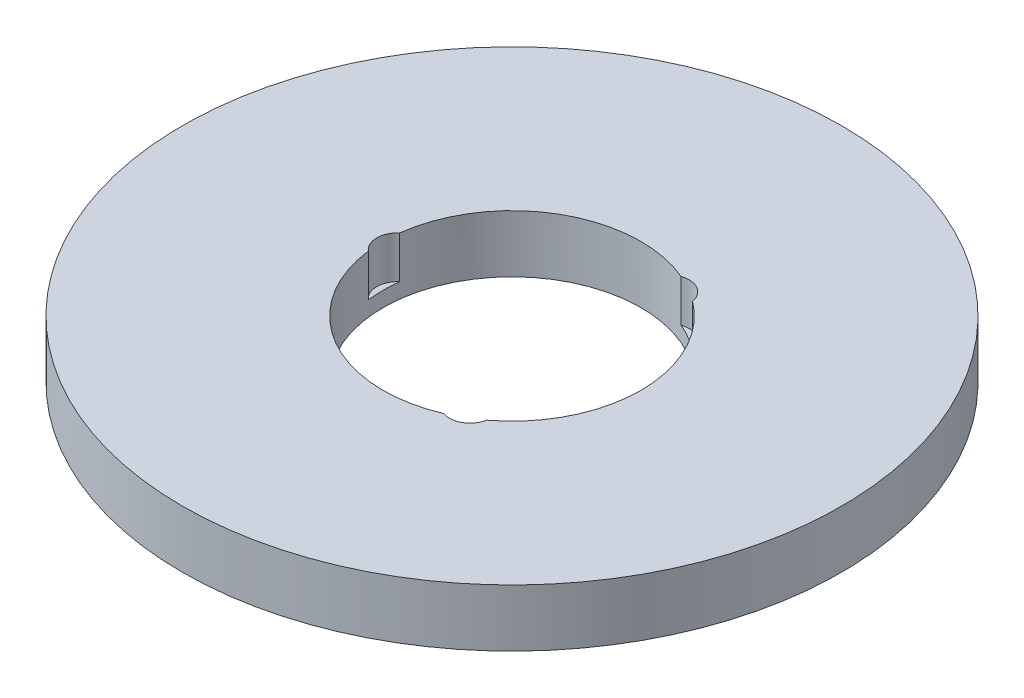
ISO-10303-21;
HEADER;
FILE_DESCRIPTION(('STEP AP214'),'2;1');
FILE_NAME('part.step','',(''),(''),'','','');
FILE_SCHEMA(('AUTOMOTIVE_DESIGN { 1 0 10303 214 1 1 1 1 }'));
ENDSEC;
DATA;
#1=APPLICATION_CONTEXT('core data for automotive mechanical design processes');
#2=APPLICATION_PROTOCOL_DEFINITION('international standard','automotive_design',2000,#1);
#3=PRODUCT_CONTEXT('',#1,'mechanical');
#4=PRODUCT('Part','Part','',(#3));
#5=PRODUCT_RELATED_PRODUCT_CATEGORY('part','',(#4));
#6=PRODUCT_DEFINITION_FORMATION('','',#4);
#7=PRODUCT_DEFINITION_CONTEXT('part definition',#1,'design');
#8=PRODUCT_DEFINITION('design','',#6,#7);
#9=PRODUCT_DEFINITION_SHAPE('','',#8);
#10=(LENGTH_UNIT() NAMED_UNIT(*) SI_UNIT(.MILLI.,.METRE.));
#11=(NAMED_UNIT(*) PLANE_ANGLE_UNIT() SI_UNIT($,.RADIAN.));
#12=(NAMED_UNIT(*) SI_UNIT($,.STERADIAN.) SOLID_ANGLE_UNIT());
#13=UNCERTAINTY_MEASURE_WITH_UNIT(LENGTH_MEASURE(1.E-05),#10,'distance_accuracy_value','');
#14=(GEOMETRIC_REPRESENTATION_CONTEXT(3) GLOBAL_UNCERTAINTY_ASSIGNED_CONTEXT((#13)) GLOBAL_UNIT_ASSIGNED_CONTEXT((#10,
#11,#12)) REPRESENTATION_CONTEXT('',''));
#15=CARTESIAN_POINT('',(0.,0.,0.));
#16=DIRECTION('',(0.,0.,1.));
#17=DIRECTION('',(1.,0.,0.));
#18=AXIS2_PLACEMENT_3D('',#15,#16,#17);
#19=CARTESIAN_POINT('',(0.,10.,0.));
#20=DIRECTION('',(0.,-1.,0.));
#21=DIRECTION('',(0.,0.,-1.));
#22=AXIS2_PLACEMENT_3D('',#19,#20,#21);
#23=CYLINDRICAL_SURFACE('',#22,57.5);
#24=CARTESIAN_POINT('',(0.,10.,0.));
#25=DIRECTION('',(0.,1.,0.));
#26=DIRECTION('',(0.,0.,1.));
#27=AXIS2_PLACEMENT_3D('',#24,#25,#26);
#28=CIRCLE('',#27,57.5);
#29=CARTESIAN_POINT('',(0.,10.,57.5));
#30=VERTEX_POINT('',#29);
#31=EDGE_CURVE('E130',#30,#30,#28,.T.);
#32=ORIENTED_EDGE('',*,*,#31,.F.);
#33=EDGE_LOOP('',(#32));
#34=FACE_BOUND('',#33,.T.);
#35=CARTESIAN_POINT('',(0.,0.,0.));
#36=DIRECTION('',(0.,1.,0.));
#37=DIRECTION('',(0.,0.,1.));
#38=AXIS2_PLACEMENT_3D('',#35,#36,#37);
#39=CIRCLE('',#38,57.5);
#40=CARTESIAN_POINT('',(0.,0.,57.5));
#41=VERTEX_POINT('',#40);
#42=EDGE_CURVE('E117',#41,#41,#39,.T.);
#43=ORIENTED_EDGE('',*,*,#42,.T.);
#44=EDGE_LOOP('',(#43));
#45=FACE_BOUND('',#44,.T.);
#46=ADVANCED_FACE('F39',(#34,#45),#23,.T.);
#47=CARTESIAN_POINT('',(0.,10.,0.));
#48=DIRECTION('',(0.,1.,0.));
#49=DIRECTION('',(0.,0.,1.));
#50=AXIS2_PLACEMENT_3D('',#47,#48,#49);
#51=PLANE('',#50);
#52=CARTESIAN_POINT('',(10.000471225053,10.,17.3213242614222));
#53=DIRECTION('',(0.,1.,0.));
#54=DIRECTION('',(0.866025403784436,0.,-0.500000000000004));
#55=AXIS2_PLACEMENT_3D('',#52,#53,#54);
#56=CIRCLE('',#55,3.59659005039731);
#57=CARTESIAN_POINT('',(8.79496633783891,10.,20.7098664195663));
#58=VERTEX_POINT('',#57);
#59=CARTESIAN_POINT('',(13.5377872594074,10.,17.9715974837805));
#60=VERTEX_POINT('',#59);
#61=EDGE_CURVE('E148',#58,#60,#56,.T.);
#62=ORIENTED_EDGE('',*,*,#61,.F.);
#63=CARTESIAN_POINT('',(0.,10.,0.));
#64=DIRECTION('',(0.,1.,0.));
#65=DIRECTION('',(0.,0.,1.));
#66=AXIS2_PLACEMENT_3D('',#63,#64,#65);
#67=CIRCLE('',#66,22.5);
#68=CARTESIAN_POINT('',(-22.3327535972461,10.,2.73826893578577));
#69=VERTEX_POINT('',#68);
#70=EDGE_CURVE('E113',#69,#58,#67,.T.);
#71=ORIENTED_EDGE('',*,*,#70,.F.);
#72=CARTESIAN_POINT('',(-20.0009424501059,10.,0.));
#73=DIRECTION('',(0.,1.,0.));
#74=DIRECTION('',(0.,0.,1.));
#75=AXIS2_PLACEMENT_3D('',#72,#73,#74);
#76=CIRCLE('',#75,3.59659005039731);
#77=CARTESIAN_POINT('',(-22.3327535972461,10.,-2.73826893578577));
#78=VERTEX_POINT('',#77);
#79=EDGE_CURVE('E125',#78,#69,#76,.T.);
#80=ORIENTED_EDGE('',*,*,#79,.F.);
#81=CARTESIAN_POINT('',(8.79496633783863,10.,-20.7098664195664));
#82=VERTEX_POINT('',#81);
#83=EDGE_CURVE('E107',#82,#78,#67,.T.);
#84=ORIENTED_EDGE('',*,*,#83,.F.);
#85=CARTESIAN_POINT('',(10.0004712250528,10.,-17.3213242614224));
#86=DIRECTION('',(0.,1.,0.));
#87=DIRECTION('',(-0.866025403784443,0.,-0.499999999999992));
#88=AXIS2_PLACEMENT_3D('',#85,#86,#87);
#89=CIRCLE('',#88,3.59659005039731);
#90=CARTESIAN_POINT('',(13.5377872594072,10.,-17.9715974837807));
#91=VERTEX_POINT('',#90);
#92=EDGE_CURVE('E95',#91,#82,#89,.T.);
#93=ORIENTED_EDGE('',*,*,#92,.F.);
#94=EDGE_CURVE('E106',#60,#91,#67,.T.);
#95=ORIENTED_EDGE('',*,*,#94,.F.);
#96=EDGE_LOOP('',(#62,#71,#80,#84,#93,#95));
#97=FACE_BOUND('',#96,.T.);
#98=ORIENTED_EDGE('',*,*,#31,.T.);
#99=EDGE_LOOP('',(#98));
#100=FACE_BOUND('',#99,.T.);
#101=ADVANCED_FACE('F102',(#97,#100),#51,.T.);
#102=CARTESIAN_POINT('',(0.,0.,0.));
#103=DIRECTION('',(0.,1.,0.));
#104=DIRECTION('',(0.,0.,1.));
#105=AXIS2_PLACEMENT_3D('',#102,#103,#104);
#106=PLANE('',#105);
#107=CARTESIAN_POINT('',(0.,0.,0.));
#108=DIRECTION('',(0.,1.,0.));
#109=DIRECTION('',(0.,0.,1.));
#110=AXIS2_PLACEMENT_3D('',#107,#108,#109);
#111=CIRCLE('',#110,22.5);
#112=CARTESIAN_POINT('',(0.,0.,22.5));
#113=VERTEX_POINT('',#112);
#114=EDGE_CURVE('E118',#113,#113,#111,.T.);
#115=ORIENTED_EDGE('',*,*,#114,.T.);
#116=EDGE_LOOP('',(#115));
#117=FACE_BOUND('',#116,.T.);
#118=ORIENTED_EDGE('',*,*,#42,.F.);
#119=EDGE_LOOP('',(#118));
#120=FACE_BOUND('',#119,.T.);
#121=ADVANCED_FACE('F161',(#117,#120),#106,.F.);
#122=CARTESIAN_POINT('',(0.,10.,0.));
#123=DIRECTION('',(0.,-1.,0.));
#124=DIRECTION('',(0.,0.,-1.));
#125=AXIS2_PLACEMENT_3D('',#122,#123,#124);
#126=CYLINDRICAL_SURFACE('',#125,22.5);
#127=DIRECTION('',(0.,1.,0.));
#128=VECTOR('',#127,1.);
#129=CARTESIAN_POINT('',(8.79496633783892,6.31430389840761,20.7098664195663));
#130=LINE('',#129,#128);
#131=CARTESIAN_POINT('',(8.79496633783891,2.62860779681522,20.7098664195663));
#132=VERTEX_POINT('',#131);
#133=EDGE_CURVE('E11',#132,#58,#130,.T.);
#134=ORIENTED_EDGE('',*,*,#133,.F.);
#135=CARTESIAN_POINT('',(0.,2.62860779681522,0.));
#136=DIRECTION('',(0.,1.,0.));
#137=DIRECTION('',(0.,0.,1.));
#138=AXIS2_PLACEMENT_3D('',#135,#136,#137);
#139=CIRCLE('',#138,22.5);
#140=CARTESIAN_POINT('',(13.5377872594074,2.62860779681522,17.9715974837805));
#141=VERTEX_POINT('',#140);
#142=EDGE_CURVE('E100',#132,#141,#139,.T.);
#143=ORIENTED_EDGE('',*,*,#142,.T.);
#144=DIRECTION('',(0.,1.,0.));
#145=VECTOR('',#144,1.);
#146=CARTESIAN_POINT('',(13.5377872594074,6.31430389840761,17.9715974837805));
#147=LINE('',#146,#145);
#148=EDGE_CURVE('E46',#60,#141,#147,.F.);
#149=ORIENTED_EDGE('',*,*,#148,.F.);
#150=ORIENTED_EDGE('',*,*,#94,.T.);
#151=DIRECTION('',(0.,1.,0.));
#152=VECTOR('',#151,1.);
#153=CARTESIAN_POINT('',(13.5377872594072,6.31430389840761,-17.9715974837807));
#154=LINE('',#153,#152);
#155=CARTESIAN_POINT('',(13.5377872594072,2.62860779681522,-17.9715974837807));
#156=VERTEX_POINT('',#155);
#157=EDGE_CURVE('E90',#156,#91,#154,.T.);
#158=ORIENTED_EDGE('',*,*,#157,.F.);
#159=CARTESIAN_POINT('',(0.,2.62860779681522,0.));
#160=DIRECTION('',(0.,1.,0.));
#161=DIRECTION('',(0.,0.,1.));
#162=AXIS2_PLACEMENT_3D('',#159,#160,#161);
#163=CIRCLE('',#162,22.5);
#164=CARTESIAN_POINT('',(8.79496633783863,2.62860779681522,-20.7098664195664));
#165=VERTEX_POINT('',#164);
#166=EDGE_CURVE('E143',#156,#165,#163,.T.);
#167=ORIENTED_EDGE('',*,*,#166,.T.);
#168=DIRECTION('',(0.,1.,0.));
#169=VECTOR('',#168,1.);
#170=CARTESIAN_POINT('',(8.79496633783863,6.31430389840761,-20.7098664195664));
#171=LINE('',#170,#169);
#172=EDGE_CURVE('E98',#82,#165,#171,.F.);
#173=ORIENTED_EDGE('',*,*,#172,.F.);
#174=ORIENTED_EDGE('',*,*,#83,.T.);
#175=DIRECTION('',(0.,1.,0.));
#176=VECTOR('',#175,1.);
#177=CARTESIAN_POINT('',(-22.3327535972462,6.31430389840761,-2.73826893578576));
#178=LINE('',#177,#176);
#179=CARTESIAN_POINT('',(-22.3327535972461,2.62860779681522,-2.73826893578577));
#180=VERTEX_POINT('',#179);
#181=EDGE_CURVE('E137',#180,#78,#178,.T.);
#182=ORIENTED_EDGE('',*,*,#181,.F.);
#183=CARTESIAN_POINT('',(0.,2.62860779681522,0.));
#184=DIRECTION('',(0.,1.,0.));
#185=DIRECTION('',(0.,0.,1.));
#186=AXIS2_PLACEMENT_3D('',#183,#184,#185);
#187=CIRCLE('',#186,22.5);
#188=CARTESIAN_POINT('',(-22.3327535972461,2.62860779681522,2.73826893578577));
#189=VERTEX_POINT('',#188);
#190=EDGE_CURVE('E128',#180,#189,#187,.T.);
#191=ORIENTED_EDGE('',*,*,#190,.T.);
#192=DIRECTION('',(0.,1.,0.));
#193=VECTOR('',#192,1.);
#194=CARTESIAN_POINT('',(-22.3327535972462,6.31430389840761,2.73826893578576));
#195=LINE('',#194,#193);
#196=EDGE_CURVE('E134',#69,#189,#195,.F.);
#197=ORIENTED_EDGE('',*,*,#196,.F.);
#198=ORIENTED_EDGE('',*,*,#70,.T.);
#199=EDGE_LOOP('',(#134,#143,#149,#150,#158,#167,#173,#174,#182,#191,#197,#198));
#200=FACE_BOUND('',#199,.T.);
#201=ORIENTED_EDGE('',*,*,#114,.F.);
#202=EDGE_LOOP('',(#201));
#203=FACE_BOUND('',#202,.T.);
#204=ADVANCED_FACE('F115',(#200,#203),#126,.F.);
#205=CARTESIAN_POINT('',(-20.0009424501059,2.62860779681522,0.));
#206=DIRECTION('',(0.,1.,0.));
#207=DIRECTION('',(0.,0.,1.));
#208=AXIS2_PLACEMENT_3D('',#205,#206,#207);
#209=CYLINDRICAL_SURFACE('',#208,3.59659005039731);
#210=ORIENTED_EDGE('',*,*,#181,.T.);
#211=ORIENTED_EDGE('',*,*,#79,.T.);
#212=ORIENTED_EDGE('',*,*,#196,.T.);
#213=CARTESIAN_POINT('',(-20.0009424501059,2.62860779681522,0.));
#214=DIRECTION('',(0.,1.,0.));
#215=DIRECTION('',(0.,0.,1.));
#216=AXIS2_PLACEMENT_3D('',#213,#214,#215);
#217=CIRCLE('',#216,3.59659005039731);
#218=EDGE_CURVE('E127',#180,#189,#217,.T.);
#219=ORIENTED_EDGE('',*,*,#218,.F.);
#220=EDGE_LOOP('',(#210,#211,#212,#219));
#221=FACE_BOUND('',#220,.T.);
#222=ADVANCED_FACE('F175',(#221),#209,.F.);
#223=CARTESIAN_POINT('',(-20.0009424501059,2.62860779681522,0.));
#224=DIRECTION('',(0.,1.,0.));
#225=DIRECTION('',(0.,0.,1.));
#226=AXIS2_PLACEMENT_3D('',#223,#224,#225);
#227=PLANE('',#226);
#228=ORIENTED_EDGE('',*,*,#218,.T.);
#229=ORIENTED_EDGE('',*,*,#190,.F.);
#230=EDGE_LOOP('',(#228,#229));
#231=FACE_BOUND('',#230,.T.);
#232=ADVANCED_FACE('F176',(#231),#227,.T.);
#233=CARTESIAN_POINT('',(10.0004712250528,2.62860779681522,-17.3213242614224));
#234=DIRECTION('',(0.,1.,0.));
#235=DIRECTION('',(0.,0.,1.));
#236=AXIS2_PLACEMENT_3D('',#233,#234,#235);
#237=CYLINDRICAL_SURFACE('',#236,3.59659005039731);
#238=ORIENTED_EDGE('',*,*,#157,.T.);
#239=ORIENTED_EDGE('',*,*,#92,.T.);
#240=ORIENTED_EDGE('',*,*,#172,.T.);
#241=CARTESIAN_POINT('',(10.0004712250528,2.62860779681522,-17.3213242614224));
#242=DIRECTION('',(0.,1.,0.));
#243=DIRECTION('',(-0.866025403784443,0.,-0.499999999999992));
#244=AXIS2_PLACEMENT_3D('',#241,#242,#243);
#245=CIRCLE('',#244,3.59659005039731);
#246=EDGE_CURVE('E56',#156,#165,#245,.T.);
#247=ORIENTED_EDGE('',*,*,#246,.F.);
#248=EDGE_LOOP('',(#238,#239,#240,#247));
#249=FACE_BOUND('',#248,.T.);
#250=ADVANCED_FACE('F93',(#249),#237,.F.);
#251=CARTESIAN_POINT('',(10.0004712250528,2.62860779681522,-17.3213242614224));
#252=DIRECTION('',(0.,1.,0.));
#253=DIRECTION('',(-0.866025403784443,0.,-0.499999999999992));
#254=AXIS2_PLACEMENT_3D('',#251,#252,#253);
#255=PLANE('',#254);
#256=ORIENTED_EDGE('',*,*,#246,.T.);
#257=ORIENTED_EDGE('',*,*,#166,.F.);
#258=EDGE_LOOP('',(#256,#257));
#259=FACE_BOUND('',#258,.T.);
#260=ADVANCED_FACE('F153',(#259),#255,.T.);
#261=CARTESIAN_POINT('',(10.000471225053,2.62860779681522,17.3213242614222));
#262=DIRECTION('',(0.,1.,0.));
#263=DIRECTION('',(0.,0.,1.));
#264=AXIS2_PLACEMENT_3D('',#261,#262,#263);
#265=CYLINDRICAL_SURFACE('',#264,3.59659005039731);
#266=ORIENTED_EDGE('',*,*,#133,.T.);
#267=ORIENTED_EDGE('',*,*,#61,.T.);
#268=ORIENTED_EDGE('',*,*,#148,.T.);
#269=CARTESIAN_POINT('',(10.000471225053,2.62860779681522,17.3213242614222));
#270=DIRECTION('',(0.,1.,0.));
#271=DIRECTION('',(0.866025403784436,0.,-0.500000000000004));
#272=AXIS2_PLACEMENT_3D('',#269,#270,#271);
#273=CIRCLE('',#272,3.59659005039731);
#274=EDGE_CURVE('E55',#132,#141,#273,.T.);
#275=ORIENTED_EDGE('',*,*,#274,.F.);
#276=EDGE_LOOP('',(#266,#267,#268,#275));
#277=FACE_BOUND('',#276,.T.);
#278=ADVANCED_FACE('F144',(#277),#265,.F.);
#279=CARTESIAN_POINT('',(10.000471225053,2.62860779681522,17.3213242614222));
#280=DIRECTION('',(0.,1.,0.));
#281=DIRECTION('',(0.866025403784436,0.,-0.500000000000004));
#282=AXIS2_PLACEMENT_3D('',#279,#280,#281);
#283=PLANE('',#282);
#284=ORIENTED_EDGE('',*,*,#274,.T.);
#285=ORIENTED_EDGE('',*,*,#142,.F.);
#286=EDGE_LOOP('',(#284,#285));
#287=FACE_BOUND('',#286,.T.);
#288=ADVANCED_FACE('F150',(#287),#283,.T.);
#289=CLOSED_SHELL('',(#46,#101,#121,#204,#222,#232,#250,#260,#278,#288));
#290=MANIFOLD_SOLID_BREP('B2',#289);
#291=ADVANCED_BREP_SHAPE_REPRESENTATION('',(#18,#290),#14);
#292=SHAPE_DEFINITION_REPRESENTATION(#9,#291);
ENDSEC;
END-ISO-10303-21;
